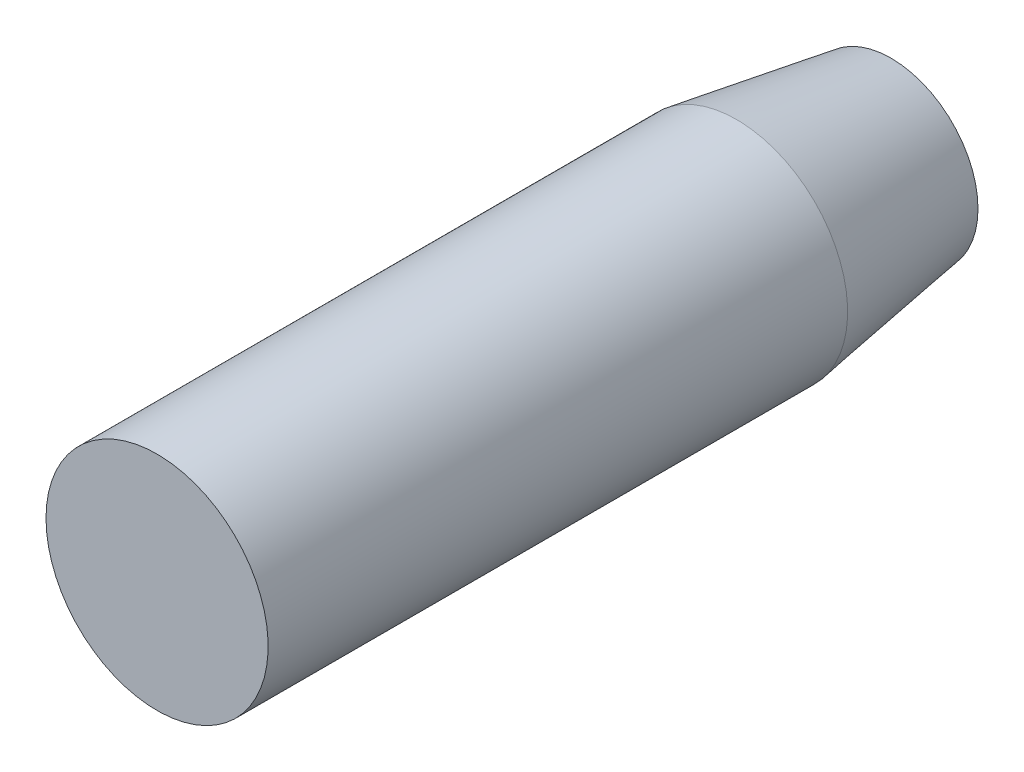
ISO-10303-21;
HEADER;
FILE_DESCRIPTION(('STEP AP214'),'2;1');
FILE_NAME('part.step','',(''),(''),'','','');
FILE_SCHEMA(('AUTOMOTIVE_DESIGN { 1 0 10303 214 1 1 1 1 }'));
ENDSEC;
DATA;
#1=APPLICATION_CONTEXT('core data for automotive mechanical design processes');
#2=APPLICATION_PROTOCOL_DEFINITION('international standard','automotive_design',2000,#1);
#3=PRODUCT_CONTEXT('',#1,'mechanical');
#4=PRODUCT('Part','Part','',(#3));
#5=PRODUCT_RELATED_PRODUCT_CATEGORY('part','',(#4));
#6=PRODUCT_DEFINITION_FORMATION('','',#4);
#7=PRODUCT_DEFINITION_CONTEXT('part definition',#1,'design');
#8=PRODUCT_DEFINITION('design','',#6,#7);
#9=PRODUCT_DEFINITION_SHAPE('','',#8);
#10=(LENGTH_UNIT() NAMED_UNIT(*) SI_UNIT(.MILLI.,.METRE.));
#11=(NAMED_UNIT(*) PLANE_ANGLE_UNIT() SI_UNIT($,.RADIAN.));
#12=(NAMED_UNIT(*) SI_UNIT($,.STERADIAN.) SOLID_ANGLE_UNIT());
#13=UNCERTAINTY_MEASURE_WITH_UNIT(LENGTH_MEASURE(1.E-05),#10,'distance_accuracy_value','');
#14=(GEOMETRIC_REPRESENTATION_CONTEXT(3) GLOBAL_UNCERTAINTY_ASSIGNED_CONTEXT((#13)) GLOBAL_UNIT_ASSIGNED_CONTEXT((#10,
#11,#12)) REPRESENTATION_CONTEXT('',''));
#15=CARTESIAN_POINT('',(0.,0.,0.));
#16=DIRECTION('',(0.,0.,1.));
#17=DIRECTION('',(1.,0.,0.));
#18=AXIS2_PLACEMENT_3D('',#15,#16,#17);
#19=CARTESIAN_POINT('',(0.,0.,-60.325));
#20=DIRECTION('',(0.,0.,1.));
#21=DIRECTION('',(-1.,0.,0.));
#22=AXIS2_PLACEMENT_3D('',#19,#20,#21);
#23=CYLINDRICAL_SURFACE('',#22,18.25625);
#24=CARTESIAN_POINT('',(0.,0.,-34.9250000000015));
#25=DIRECTION('',(0.,0.,1.));
#26=DIRECTION('',(1.,0.,0.));
#27=AXIS2_PLACEMENT_3D('',#24,#25,#26);
#28=CIRCLE('',#27,18.25625);
#29=CARTESIAN_POINT('',(-18.25625,0.,-34.9250000000015));
#30=VERTEX_POINT('',#29);
#31=EDGE_CURVE('E10',#30,#30,#28,.F.);
#32=CARTESIAN_POINT('',(0.,0.,60.325));
#33=DIRECTION('',(0.,0.,1.));
#34=DIRECTION('',(1.,0.,0.));
#35=AXIS2_PLACEMENT_3D('',#32,#33,#34);
#36=CIRCLE('',#35,18.25625);
#37=CARTESIAN_POINT('',(-18.25625,0.,60.325));
#38=VERTEX_POINT('',#37);
#39=EDGE_CURVE('E44',#38,#38,#36,.T.);
#40=CARTESIAN_POINT('',(-18.25625,0.,-34.9250000000015));
#41=CARTESIAN_POINT('',(-18.25625,0.,-33.9328125000015));
#42=CARTESIAN_POINT('',(-18.25625,0.,-32.9406250000014));
#43=CARTESIAN_POINT('',(-18.25625,0.,-30.9562500000014));
#44=CARTESIAN_POINT('',(-18.25625,0.,-29.9640625000014));
#45=CARTESIAN_POINT('',(-18.25625,0.,-27.9796875000014));
#46=CARTESIAN_POINT('',(-18.25625,0.,-26.9875000000014));
#47=CARTESIAN_POINT('',(-18.25625,0.,-25.0031250000013));
#48=CARTESIAN_POINT('',(-18.25625,0.,-24.0109375000013));
#49=CARTESIAN_POINT('',(-18.25625,0.,-22.0265625000013));
#50=CARTESIAN_POINT('',(-18.25625,0.,-21.0343750000013));
#51=CARTESIAN_POINT('',(-18.25625,0.,-19.0500000000012));
#52=CARTESIAN_POINT('',(-18.25625,0.,-18.0578125000012));
#53=CARTESIAN_POINT('',(-18.25625,0.,-16.0734375000012));
#54=CARTESIAN_POINT('',(-18.25625,0.,-15.0812500000012));
#55=CARTESIAN_POINT('',(-18.25625,0.,-13.0968750000011));
#56=CARTESIAN_POINT('',(-18.25625,0.,-12.1046875000011));
#57=CARTESIAN_POINT('',(-18.25625,0.,-10.1203125000011));
#58=CARTESIAN_POINT('',(-18.25625,0.,-9.12812500000108));
#59=CARTESIAN_POINT('',(-18.25625,0.,-7.14375000000105));
#60=CARTESIAN_POINT('',(-18.25625,0.,-6.15156250000103));
#61=CARTESIAN_POINT('',(-18.25625,0.,-4.167187500001));
#62=CARTESIAN_POINT('',(-18.25625,0.,-3.17500000000099));
#63=CARTESIAN_POINT('',(-18.25625,0.,-1.19062500000096));
#64=CARTESIAN_POINT('',(-18.25625,0.,-0.198437500000941));
#65=CARTESIAN_POINT('',(-18.25625,0.,1.78593749999909));
#66=CARTESIAN_POINT('',(-18.25625,0.,2.7781249999991));
#67=CARTESIAN_POINT('',(-18.25625,0.,4.76249999999913));
#68=CARTESIAN_POINT('',(-18.25625,0.,5.75468749999915));
#69=CARTESIAN_POINT('',(-18.25625,0.,7.73906249999918));
#70=CARTESIAN_POINT('',(-18.25625,0.,8.7312499999992));
#71=CARTESIAN_POINT('',(-18.25625,0.,10.7156249999992));
#72=CARTESIAN_POINT('',(-18.25625,0.,11.7078124999992));
#73=CARTESIAN_POINT('',(-18.25625,0.,13.6921874999993));
#74=CARTESIAN_POINT('',(-18.25625,0.,14.6843749999993));
#75=CARTESIAN_POINT('',(-18.25625,0.,16.6687499999993));
#76=CARTESIAN_POINT('',(-18.25625,0.,17.6609374999993));
#77=CARTESIAN_POINT('',(-18.25625,0.,19.6453124999994));
#78=CARTESIAN_POINT('',(-18.25625,0.,20.6374999999994));
#79=CARTESIAN_POINT('',(-18.25625,0.,22.6218749999994));
#80=CARTESIAN_POINT('',(-18.25625,0.,23.6140624999994));
#81=CARTESIAN_POINT('',(-18.25625,0.,25.5984374999995));
#82=CARTESIAN_POINT('',(-18.25625,0.,26.5906249999995));
#83=CARTESIAN_POINT('',(-18.25625,0.,28.5749999999995));
#84=CARTESIAN_POINT('',(-18.25625,0.,29.5671874999995));
#85=CARTESIAN_POINT('',(-18.25625,0.,31.5515624999995));
#86=CARTESIAN_POINT('',(-18.25625,0.,32.5437499999996));
#87=CARTESIAN_POINT('',(-18.25625,0.,34.5281249999996));
#88=CARTESIAN_POINT('',(-18.25625,0.,35.5203124999996));
#89=CARTESIAN_POINT('',(-18.25625,0.,37.5046874999996));
#90=CARTESIAN_POINT('',(-18.25625,0.,38.4968749999997));
#91=CARTESIAN_POINT('',(-18.25625,0.,40.4812499999997));
#92=CARTESIAN_POINT('',(-18.25625,0.,41.4734374999997));
#93=CARTESIAN_POINT('',(-18.25625,0.,43.4578124999997));
#94=CARTESIAN_POINT('',(-18.25625,0.,44.4499999999997));
#95=CARTESIAN_POINT('',(-18.25625,0.,46.4343749999998));
#96=CARTESIAN_POINT('',(-18.25625,0.,47.4265624999998));
#97=CARTESIAN_POINT('',(-18.25625,0.,49.4109374999998));
#98=CARTESIAN_POINT('',(-18.25625,0.,50.4031249999998));
#99=CARTESIAN_POINT('',(-18.25625,0.,52.3874999999999));
#100=CARTESIAN_POINT('',(-18.25625,0.,53.3796874999999));
#101=CARTESIAN_POINT('',(-18.25625,0.,55.3640624999999));
#102=CARTESIAN_POINT('',(-18.25625,0.,56.3562499999999));
#103=CARTESIAN_POINT('',(-18.25625,0.,58.340625));
#104=CARTESIAN_POINT('',(-18.25625,0.,59.3328125));
#105=CARTESIAN_POINT('',(-18.25625,0.,60.325));
#106=B_SPLINE_CURVE_WITH_KNOTS('',3,(#40,#41,#42,#43,#44,#45,#46,#47,#48,#49,#50,#51,#52,#53,
#54,#55,#56,#57,#58,#59,#60,#61,#62,#63,#64,#65,#66,#67,#68,#69,#70,#71,#72,#73,#74,#75,#76,#77,
#78,#79,#80,#81,#82,#83,#84,#85,#86,#87,#88,#89,#90,#91,#92,#93,#94,#95,#96,#97,#98,#99,#100,
#101,#102,#103,#104,#105),.UNSPECIFIED.,.F.,.F.,(4,2,2,2,2,2,2,2,2,2,2,2,2,2,2,2,2,2,2,2,2,2,2,
2,2,2,2,2,2,2,2,2,4),(0.,2.97656250000004,5.95312500000009,8.92968750000013,11.9062500000002,
14.8828125000002,17.8593750000003,20.8359375000003,23.8125000000004,26.7890625000004,
29.7656250000005,32.7421875000005,35.7187500000005,38.6953125000006,41.6718750000006,
44.6484375000007,47.6250000000007,50.6015625000008,53.5781250000008,56.5546875000009,
59.5312500000009,62.507812500001,65.484375000001,68.460937500001,71.4375000000011,
74.4140625000012,77.3906250000012,80.3671875000012,83.3437500000013,86.3203125000013,
89.2968750000014,92.2734375000014,95.2500000000015),.UNSPECIFIED.);
#107=EDGE_CURVE('BSEAM33',#30,#38,#106,.T.);
#108=ORIENTED_EDGE('',*,*,#31,.F.);
#109=ORIENTED_EDGE('',*,*,#39,.F.);
#110=ORIENTED_EDGE('',*,*,#107,.T.);
#111=ORIENTED_EDGE('',*,*,#107,.F.);
#112=EDGE_LOOP('',(#108,#110,#109,#111));
#113=FACE_BOUND('',#112,.T.);
#114=ADVANCED_FACE('F33',(#113),#23,.T.);
#115=CARTESIAN_POINT('',(0.,0.,-60.325));
#116=DIRECTION('',(0.,0.,-1.));
#117=DIRECTION('',(1.,0.,0.));
#118=AXIS2_PLACEMENT_3D('',#115,#116,#117);
#119=PLANE('',#118);
#120=CARTESIAN_POINT('',(0.,0.,-60.325));
#121=DIRECTION('',(0.,0.,1.));
#122=DIRECTION('',(1.,0.,0.));
#123=AXIS2_PLACEMENT_3D('',#120,#121,#122);
#124=CIRCLE('',#123,14.2875000000003);
#125=CARTESIAN_POINT('',(-14.2875000000003,0.,-60.325));
#126=VERTEX_POINT('',#125);
#127=EDGE_CURVE('E40',#126,#126,#124,.T.);
#128=ORIENTED_EDGE('',*,*,#127,.F.);
#129=EDGE_LOOP('',(#128));
#130=FACE_BOUND('',#129,.T.);
#131=ADVANCED_FACE('F54',(#130),#119,.T.);
#132=CARTESIAN_POINT('',(0.,0.,60.325));
#133=DIRECTION('',(0.,0.,-1.));
#134=DIRECTION('',(1.,0.,0.));
#135=AXIS2_PLACEMENT_3D('',#132,#133,#134);
#136=PLANE('',#135);
#137=ORIENTED_EDGE('',*,*,#39,.T.);
#138=EDGE_LOOP('',(#137));
#139=FACE_BOUND('',#138,.T.);
#140=ADVANCED_FACE('F51',(#139),#136,.F.);
#141=CARTESIAN_POINT('',(0.,0.,-60.325));
#142=DIRECTION('',(0.,0.,1.));
#143=DIRECTION('',(-1.,0.,0.));
#144=AXIS2_PLACEMENT_3D('',#141,#142,#143);
#145=CONICAL_SURFACE('',#144,14.2875000000003,0.154996741923938);
#146=CARTESIAN_POINT('',(-18.25625,0.,-34.9250000000015));
#147=CARTESIAN_POINT('',(-18.2149088541667,0.,-35.1895833333348));
#148=CARTESIAN_POINT('',(-18.1735677083333,0.,-35.4541666666681));
#149=CARTESIAN_POINT('',(-18.0908854166667,0.,-35.9833333333347));
#150=CARTESIAN_POINT('',(-18.0495442708333,0.,-36.2479166666681));
#151=CARTESIAN_POINT('',(-17.9668619791667,0.,-36.7770833333347));
#152=CARTESIAN_POINT('',(-17.9255208333334,0.,-37.041666666668));
#153=CARTESIAN_POINT('',(-17.8428385416667,0.,-37.5708333333346));
#154=CARTESIAN_POINT('',(-17.8014973958334,0.,-37.835416666668));
#155=CARTESIAN_POINT('',(-17.7188151041667,0.,-38.3645833333346));
#156=CARTESIAN_POINT('',(-17.6774739583334,0.,-38.6291666666679));
#157=CARTESIAN_POINT('',(-17.5947916666667,0.,-39.1583333333346));
#158=CARTESIAN_POINT('',(-17.5534505208334,0.,-39.4229166666679));
#159=CARTESIAN_POINT('',(-17.4707682291667,0.,-39.9520833333345));
#160=CARTESIAN_POINT('',(-17.4294270833334,0.,-40.2166666666678));
#161=CARTESIAN_POINT('',(-17.3467447916667,0.,-40.7458333333345));
#162=CARTESIAN_POINT('',(-17.3054036458334,0.,-41.0104166666678));
#163=CARTESIAN_POINT('',(-17.2227213541668,0.,-41.5395833333344));
#164=CARTESIAN_POINT('',(-17.1813802083334,0.,-41.8041666666677));
#165=CARTESIAN_POINT('',(-17.0986979166668,0.,-42.3333333333344));
#166=CARTESIAN_POINT('',(-17.0573567708334,0.,-42.5979166666677));
#167=CARTESIAN_POINT('',(-16.9746744791668,0.,-43.1270833333343));
#168=CARTESIAN_POINT('',(-16.9333333333334,0.,-43.3916666666676));
#169=CARTESIAN_POINT('',(-16.8506510416668,0.,-43.9208333333343));
#170=CARTESIAN_POINT('',(-16.8093098958335,0.,-44.1854166666676));
#171=CARTESIAN_POINT('',(-16.7266276041668,0.,-44.7145833333342));
#172=CARTESIAN_POINT('',(-16.6852864583335,0.,-44.9791666666676));
#173=CARTESIAN_POINT('',(-16.6026041666668,0.,-45.5083333333342));
#174=CARTESIAN_POINT('',(-16.5612630208335,0.,-45.7729166666675));
#175=CARTESIAN_POINT('',(-16.4785807291668,0.,-46.3020833333341));
#176=CARTESIAN_POINT('',(-16.4372395833335,0.,-46.5666666666675));
#177=CARTESIAN_POINT('',(-16.3545572916668,0.,-47.0958333333341));
#178=CARTESIAN_POINT('',(-16.3132161458335,0.,-47.3604166666674));
#179=CARTESIAN_POINT('',(-16.2305338541668,0.,-47.8895833333341));
#180=CARTESIAN_POINT('',(-16.1891927083335,0.,-48.1541666666674));
#181=CARTESIAN_POINT('',(-16.1065104166668,0.,-48.683333333334));
#182=CARTESIAN_POINT('',(-16.0651692708335,0.,-48.9479166666673));
#183=CARTESIAN_POINT('',(-15.9824869791668,0.,-49.477083333334));
#184=CARTESIAN_POINT('',(-15.9411458333335,0.,-49.7416666666673));
#185=CARTESIAN_POINT('',(-15.8584635416669,0.,-50.2708333333339));
#186=CARTESIAN_POINT('',(-15.8171223958335,0.,-50.5354166666672));
#187=CARTESIAN_POINT('',(-15.7344401041669,0.,-51.0645833333339));
#188=CARTESIAN_POINT('',(-15.6930989583335,0.,-51.3291666666672));
#189=CARTESIAN_POINT('',(-15.6104166666669,0.,-51.8583333333338));
#190=CARTESIAN_POINT('',(-15.5690755208336,0.,-52.1229166666671));
#191=CARTESIAN_POINT('',(-15.4863932291669,0.,-52.6520833333338));
#192=CARTESIAN_POINT('',(-15.4450520833336,0.,-52.9166666666671));
#193=CARTESIAN_POINT('',(-15.3623697916669,0.,-53.4458333333337));
#194=CARTESIAN_POINT('',(-15.3210286458336,0.,-53.7104166666671));
#195=CARTESIAN_POINT('',(-15.2383463541669,0.,-54.2395833333337));
#196=CARTESIAN_POINT('',(-15.1970052083336,0.,-54.504166666667));
#197=CARTESIAN_POINT('',(-15.1143229166669,0.,-55.0333333333336));
#198=CARTESIAN_POINT('',(-15.0729817708336,0.,-55.297916666667));
#199=CARTESIAN_POINT('',(-14.9902994791669,0.,-55.8270833333336));
#200=CARTESIAN_POINT('',(-14.9489583333336,0.,-56.0916666666669));
#201=CARTESIAN_POINT('',(-14.8662760416669,0.,-56.6208333333336));
#202=CARTESIAN_POINT('',(-14.8249348958336,0.,-56.8854166666669));
#203=CARTESIAN_POINT('',(-14.7422526041669,0.,-57.4145833333335));
#204=CARTESIAN_POINT('',(-14.7009114583336,0.,-57.6791666666668));
#205=CARTESIAN_POINT('',(-14.618229166667,0.,-58.2083333333335));
#206=CARTESIAN_POINT('',(-14.5768880208336,0.,-58.4729166666668));
#207=CARTESIAN_POINT('',(-14.494205729167,0.,-59.0020833333334));
#208=CARTESIAN_POINT('',(-14.4528645833336,0.,-59.2666666666667));
#209=CARTESIAN_POINT('',(-14.370182291667,0.,-59.7958333333334));
#210=CARTESIAN_POINT('',(-14.3288411458337,0.,-60.0604166666667));
#211=CARTESIAN_POINT('',(-14.2875000000003,0.,-60.325));
#212=B_SPLINE_CURVE_WITH_KNOTS('',3,(#146,#147,#148,#149,#150,#151,#152,#153,#154,#155,#156,
#157,#158,#159,#160,#161,#162,#163,#164,#165,#166,#167,#168,#169,#170,#171,#172,#173,#174,#175,
#176,#177,#178,#179,#180,#181,#182,#183,#184,#185,#186,#187,#188,#189,#190,#191,#192,#193,#194,
#195,#196,#197,#198,#199,#200,#201,#202,#203,#204,#205,#206,#207,#208,#209,#210,#211),
.UNSPECIFIED.,.F.,.F.,(4,2,2,2,2,2,2,2,2,2,2,2,2,2,2,2,2,2,2,2,2,2,2,2,2,2,2,2,2,2,2,2,4),(0.,
0.803380903151949,1.6067618063039,2.41014270945585,3.2135236126078,4.01690451575974,
4.82028541891169,5.62366632206364,6.42704722521559,7.23042812836754,8.03380903151949,
8.83718993467144,9.64057083782339,10.4439517409753,11.2473326441273,12.0507135472792,
12.8540944504312,13.6574753535831,14.4608562567351,15.264237159887,16.067618063039,
16.8709989661909,17.6743798693429,18.4777607724948,19.2811416756468,20.0845225787987,
20.8879034819507,21.6912843851026,22.4946652882546,23.2980461914065,24.1014270945585,
24.9048079977104,25.7081889008623),.UNSPECIFIED.);
#213=EDGE_CURVE('BSEAM35',#30,#126,#212,.T.);
#214=ORIENTED_EDGE('',*,*,#31,.T.);
#215=ORIENTED_EDGE('',*,*,#127,.T.);
#216=ORIENTED_EDGE('',*,*,#213,.T.);
#217=ORIENTED_EDGE('',*,*,#213,.F.);
#218=EDGE_LOOP('',(#214,#216,#215,#217));
#219=FACE_BOUND('',#218,.T.);
#220=ADVANCED_FACE('F35',(#219),#145,.T.);
#221=CLOSED_SHELL('',(#114,#131,#140,#220));
#222=MANIFOLD_SOLID_BREP('B2',#221);
#223=ADVANCED_BREP_SHAPE_REPRESENTATION('',(#18,#222),#14);
#224=SHAPE_DEFINITION_REPRESENTATION(#9,#223);
ENDSEC;
END-ISO-10303-21;
